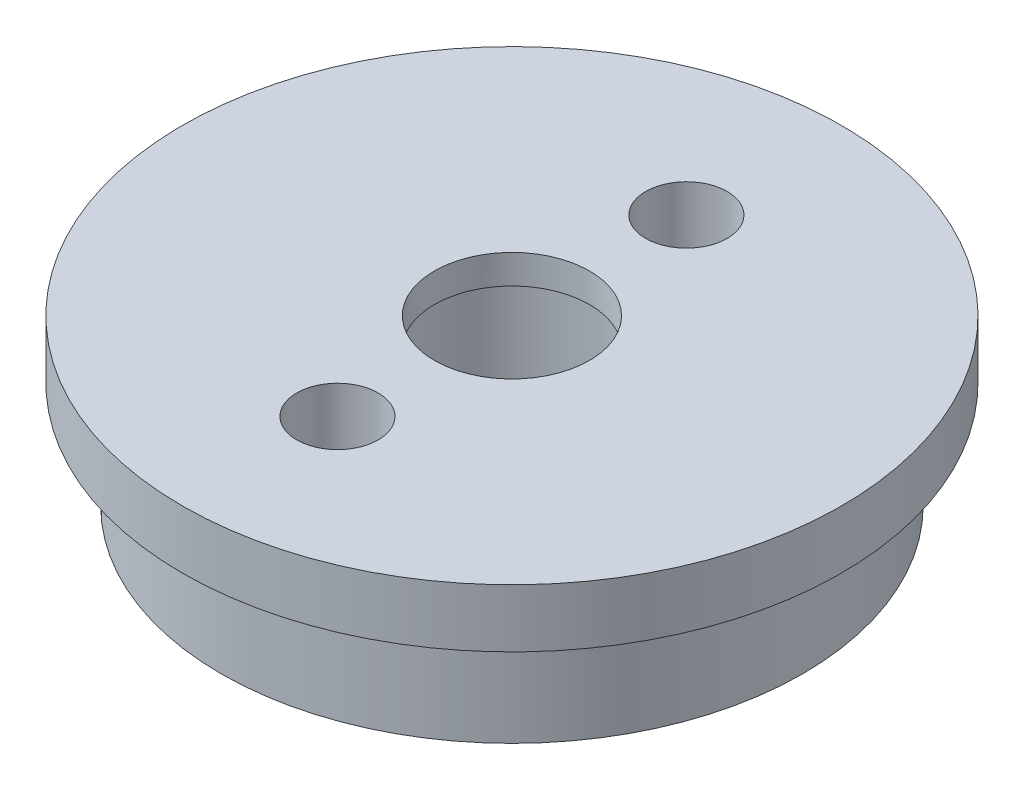
ISO-10303-21;
HEADER;
FILE_DESCRIPTION(('STEP AP214'),'2;1');
FILE_NAME('part.step','',(''),(''),'','','');
FILE_SCHEMA(('AUTOMOTIVE_DESIGN { 1 0 10303 214 1 1 1 1 }'));
ENDSEC;
DATA;
#1=APPLICATION_CONTEXT('core data for automotive mechanical design processes');
#2=APPLICATION_PROTOCOL_DEFINITION('international standard','automotive_design',2000,#1);
#3=PRODUCT_CONTEXT('',#1,'mechanical');
#4=PRODUCT('Part','Part','',(#3));
#5=PRODUCT_RELATED_PRODUCT_CATEGORY('part','',(#4));
#6=PRODUCT_DEFINITION_FORMATION('','',#4);
#7=PRODUCT_DEFINITION_CONTEXT('part definition',#1,'design');
#8=PRODUCT_DEFINITION('design','',#6,#7);
#9=PRODUCT_DEFINITION_SHAPE('','',#8);
#10=(LENGTH_UNIT() NAMED_UNIT(*) SI_UNIT(.MILLI.,.METRE.));
#11=(NAMED_UNIT(*) PLANE_ANGLE_UNIT() SI_UNIT($,.RADIAN.));
#12=(NAMED_UNIT(*) SI_UNIT($,.STERADIAN.) SOLID_ANGLE_UNIT());
#13=UNCERTAINTY_MEASURE_WITH_UNIT(LENGTH_MEASURE(1.E-05),#10,'distance_accuracy_value','');
#14=(GEOMETRIC_REPRESENTATION_CONTEXT(3) GLOBAL_UNCERTAINTY_ASSIGNED_CONTEXT((#13)) GLOBAL_UNIT_ASSIGNED_CONTEXT((#10,
#11,#12)) REPRESENTATION_CONTEXT('',''));
#15=CARTESIAN_POINT('',(0.,0.,0.));
#16=DIRECTION('',(0.,0.,1.));
#17=DIRECTION('',(1.,0.,0.));
#18=AXIS2_PLACEMENT_3D('',#15,#16,#17);
#19=CARTESIAN_POINT('',(0.,5.5,0.));
#20=DIRECTION('',(0.,-1.,0.));
#21=DIRECTION('',(0.,0.,-1.));
#22=AXIS2_PLACEMENT_3D('',#19,#20,#21);
#23=CYLINDRICAL_SURFACE('',#22,15.);
#24=CARTESIAN_POINT('',(0.,5.5,0.));
#25=DIRECTION('',(0.,1.,0.));
#26=DIRECTION('',(0.,0.,1.));
#27=AXIS2_PLACEMENT_3D('',#24,#25,#26);
#28=CIRCLE('',#27,15.);
#29=CARTESIAN_POINT('',(0.,5.5,15.));
#30=VERTEX_POINT('',#29);
#31=EDGE_CURVE('E10',#30,#30,#28,.T.);
#32=ORIENTED_EDGE('',*,*,#31,.F.);
#33=EDGE_LOOP('',(#32));
#34=FACE_BOUND('',#33,.T.);
#35=CARTESIAN_POINT('',(0.,0.,0.));
#36=DIRECTION('',(0.,1.,0.));
#37=DIRECTION('',(0.,0.,1.));
#38=AXIS2_PLACEMENT_3D('',#35,#36,#37);
#39=CIRCLE('',#38,15.);
#40=CARTESIAN_POINT('',(0.,0.,15.));
#41=VERTEX_POINT('',#40);
#42=EDGE_CURVE('E38',#41,#41,#39,.T.);
#43=ORIENTED_EDGE('',*,*,#42,.T.);
#44=EDGE_LOOP('',(#43));
#45=FACE_BOUND('',#44,.T.);
#46=ADVANCED_FACE('F31',(#34,#45),#23,.T.);
#47=CARTESIAN_POINT('',(0.,0.,0.));
#48=DIRECTION('',(0.,1.,0.));
#49=DIRECTION('',(0.,0.,1.));
#50=AXIS2_PLACEMENT_3D('',#47,#48,#49);
#51=PLANE('',#50);
#52=CARTESIAN_POINT('',(0.,0.,0.));
#53=DIRECTION('',(0.,-1.,0.));
#54=DIRECTION('',(0.,0.,-1.));
#55=AXIS2_PLACEMENT_3D('',#52,#53,#54);
#56=CIRCLE('',#55,5.1);
#57=CARTESIAN_POINT('',(0.,0.,-5.1));
#58=VERTEX_POINT('',#57);
#59=EDGE_CURVE('E51',#58,#58,#56,.T.);
#60=ORIENTED_EDGE('',*,*,#59,.F.);
#61=EDGE_LOOP('',(#60));
#62=FACE_BOUND('',#61,.T.);
#63=ORIENTED_EDGE('',*,*,#42,.F.);
#64=EDGE_LOOP('',(#63));
#65=FACE_BOUND('',#64,.T.);
#66=ADVANCED_FACE('F91',(#62,#65),#51,.F.);
#67=CARTESIAN_POINT('',(0.,8.5,0.));
#68=DIRECTION('',(0.,-1.,0.));
#69=DIRECTION('',(0.,0.,-1.));
#70=AXIS2_PLACEMENT_3D('',#67,#68,#69);
#71=CYLINDRICAL_SURFACE('',#70,17.);
#72=CARTESIAN_POINT('',(0.,8.5,0.));
#73=DIRECTION('',(0.,1.,0.));
#74=DIRECTION('',(0.,0.,1.));
#75=AXIS2_PLACEMENT_3D('',#72,#73,#74);
#76=CIRCLE('',#75,17.);
#77=CARTESIAN_POINT('',(0.,8.5,17.));
#78=VERTEX_POINT('',#77);
#79=EDGE_CURVE('E43',#78,#78,#76,.T.);
#80=ORIENTED_EDGE('',*,*,#79,.F.);
#81=EDGE_LOOP('',(#80));
#82=FACE_BOUND('',#81,.T.);
#83=CARTESIAN_POINT('',(0.,5.5,0.));
#84=DIRECTION('',(0.,1.,0.));
#85=DIRECTION('',(0.,0.,1.));
#86=AXIS2_PLACEMENT_3D('',#83,#84,#85);
#87=CIRCLE('',#86,17.);
#88=CARTESIAN_POINT('',(0.,5.5,17.));
#89=VERTEX_POINT('',#88);
#90=EDGE_CURVE('E45',#89,#89,#87,.T.);
#91=ORIENTED_EDGE('',*,*,#90,.T.);
#92=EDGE_LOOP('',(#91));
#93=FACE_BOUND('',#92,.T.);
#94=ADVANCED_FACE('F94',(#82,#93),#71,.T.);
#95=CARTESIAN_POINT('',(0.,8.5,0.));
#96=DIRECTION('',(0.,1.,0.));
#97=DIRECTION('',(0.,0.,1.));
#98=AXIS2_PLACEMENT_3D('',#95,#96,#97);
#99=PLANE('',#98);
#100=CARTESIAN_POINT('',(0.,8.5,-9.));
#101=DIRECTION('',(0.,1.,0.));
#102=DIRECTION('',(0.,0.,1.));
#103=AXIS2_PLACEMENT_3D('',#100,#101,#102);
#104=CIRCLE('',#103,2.1);
#105=CARTESIAN_POINT('',(0.,8.5,-6.9));
#106=VERTEX_POINT('',#105);
#107=EDGE_CURVE('E65',#106,#106,#104,.T.);
#108=ORIENTED_EDGE('',*,*,#107,.F.);
#109=EDGE_LOOP('',(#108));
#110=FACE_BOUND('',#109,.T.);
#111=CARTESIAN_POINT('',(0.,8.5,9.));
#112=DIRECTION('',(0.,1.,0.));
#113=DIRECTION('',(0.,0.,1.));
#114=AXIS2_PLACEMENT_3D('',#111,#112,#113);
#115=CIRCLE('',#114,2.1);
#116=CARTESIAN_POINT('',(0.,8.5,11.1));
#117=VERTEX_POINT('',#116);
#118=EDGE_CURVE('E59',#117,#117,#115,.T.);
#119=ORIENTED_EDGE('',*,*,#118,.F.);
#120=EDGE_LOOP('',(#119));
#121=FACE_BOUND('',#120,.T.);
#122=CARTESIAN_POINT('',(0.,8.5,0.));
#123=DIRECTION('',(0.,1.,0.));
#124=DIRECTION('',(0.,0.,1.));
#125=AXIS2_PLACEMENT_3D('',#122,#123,#124);
#126=CIRCLE('',#125,4.);
#127=CARTESIAN_POINT('',(0.,8.5,4.));
#128=VERTEX_POINT('',#127);
#129=EDGE_CURVE('E56',#128,#128,#126,.T.);
#130=ORIENTED_EDGE('',*,*,#129,.F.);
#131=EDGE_LOOP('',(#130));
#132=FACE_BOUND('',#131,.T.);
#133=ORIENTED_EDGE('',*,*,#79,.T.);
#134=EDGE_LOOP('',(#133));
#135=FACE_BOUND('',#134,.T.);
#136=ADVANCED_FACE('F113',(#110,#121,#132,#135),#99,.T.);
#137=CARTESIAN_POINT('',(0.,5.5,0.));
#138=DIRECTION('',(0.,1.,0.));
#139=DIRECTION('',(0.,0.,1.));
#140=AXIS2_PLACEMENT_3D('',#137,#138,#139);
#141=PLANE('',#140);
#142=ORIENTED_EDGE('',*,*,#31,.T.);
#143=EDGE_LOOP('',(#142));
#144=FACE_BOUND('',#143,.T.);
#145=ORIENTED_EDGE('',*,*,#90,.F.);
#146=EDGE_LOOP('',(#145));
#147=FACE_BOUND('',#146,.T.);
#148=ADVANCED_FACE('F87',(#144,#147),#141,.F.);
#149=CARTESIAN_POINT('',(0.,7.,0.));
#150=DIRECTION('',(0.,-1.,0.));
#151=DIRECTION('',(0.,0.,-1.));
#152=AXIS2_PLACEMENT_3D('',#149,#150,#151);
#153=CYLINDRICAL_SURFACE('',#152,5.1);
#154=CARTESIAN_POINT('',(0.,7.,0.));
#155=DIRECTION('',(0.,-1.,0.));
#156=DIRECTION('',(0.,0.,-1.));
#157=AXIS2_PLACEMENT_3D('',#154,#155,#156);
#158=CIRCLE('',#157,5.1);
#159=CARTESIAN_POINT('',(0.,7.,-5.1));
#160=VERTEX_POINT('',#159);
#161=EDGE_CURVE('E48',#160,#160,#158,.T.);
#162=ORIENTED_EDGE('',*,*,#161,.F.);
#163=EDGE_LOOP('',(#162));
#164=FACE_BOUND('',#163,.T.);
#165=ORIENTED_EDGE('',*,*,#59,.T.);
#166=EDGE_LOOP('',(#165));
#167=FACE_BOUND('',#166,.T.);
#168=ADVANCED_FACE('F81',(#164,#167),#153,.F.);
#169=CARTESIAN_POINT('',(0.,7.,0.));
#170=DIRECTION('',(0.,-1.,0.));
#171=DIRECTION('',(0.,0.,-1.));
#172=AXIS2_PLACEMENT_3D('',#169,#170,#171);
#173=PLANE('',#172);
#174=CARTESIAN_POINT('',(0.,7.,0.));
#175=DIRECTION('',(0.,-1.,0.));
#176=DIRECTION('',(0.,0.,-1.));
#177=AXIS2_PLACEMENT_3D('',#174,#175,#176);
#178=CIRCLE('',#177,4.);
#179=CARTESIAN_POINT('',(0.,7.,-4.));
#180=VERTEX_POINT('',#179);
#181=EDGE_CURVE('E34',#180,#180,#178,.T.);
#182=ORIENTED_EDGE('',*,*,#181,.F.);
#183=EDGE_LOOP('',(#182));
#184=FACE_BOUND('',#183,.T.);
#185=ORIENTED_EDGE('',*,*,#161,.T.);
#186=EDGE_LOOP('',(#185));
#187=FACE_BOUND('',#186,.T.);
#188=ADVANCED_FACE('F78',(#184,#187),#173,.T.);
#189=CARTESIAN_POINT('',(0.,2.5,0.));
#190=DIRECTION('',(0.,1.,0.));
#191=DIRECTION('',(0.,0.,1.));
#192=AXIS2_PLACEMENT_3D('',#189,#190,#191);
#193=CYLINDRICAL_SURFACE('',#192,4.);
#194=ORIENTED_EDGE('',*,*,#181,.T.);
#195=EDGE_LOOP('',(#194));
#196=FACE_BOUND('',#195,.T.);
#197=ORIENTED_EDGE('',*,*,#129,.T.);
#198=EDGE_LOOP('',(#197));
#199=FACE_BOUND('',#198,.T.);
#200=ADVANCED_FACE('F75',(#196,#199),#193,.F.);
#201=CARTESIAN_POINT('',(0.,2.5,9.));
#202=DIRECTION('',(0.,1.,0.));
#203=DIRECTION('',(0.,0.,1.));
#204=AXIS2_PLACEMENT_3D('',#201,#202,#203);
#205=CYLINDRICAL_SURFACE('',#204,2.1);
#206=CARTESIAN_POINT('',(0.,2.5,9.));
#207=DIRECTION('',(0.,1.,0.));
#208=DIRECTION('',(0.,0.,1.));
#209=AXIS2_PLACEMENT_3D('',#206,#207,#208);
#210=CIRCLE('',#209,2.1);
#211=CARTESIAN_POINT('',(0.,2.5,11.1));
#212=VERTEX_POINT('',#211);
#213=EDGE_CURVE('E62',#212,#212,#210,.T.);
#214=ORIENTED_EDGE('',*,*,#213,.F.);
#215=EDGE_LOOP('',(#214));
#216=FACE_BOUND('',#215,.T.);
#217=ORIENTED_EDGE('',*,*,#118,.T.);
#218=EDGE_LOOP('',(#217));
#219=FACE_BOUND('',#218,.T.);
#220=ADVANCED_FACE('F140',(#216,#219),#205,.F.);
#221=CARTESIAN_POINT('',(0.,2.5,9.));
#222=DIRECTION('',(0.,1.,0.));
#223=DIRECTION('',(0.,0.,1.));
#224=AXIS2_PLACEMENT_3D('',#221,#222,#223);
#225=PLANE('',#224);
#226=ORIENTED_EDGE('',*,*,#213,.T.);
#227=EDGE_LOOP('',(#226));
#228=FACE_BOUND('',#227,.T.);
#229=ADVANCED_FACE('F147',(#228),#225,.T.);
#230=CARTESIAN_POINT('',(0.,2.5,-9.));
#231=DIRECTION('',(0.,1.,0.));
#232=DIRECTION('',(0.,0.,1.));
#233=AXIS2_PLACEMENT_3D('',#230,#231,#232);
#234=CYLINDRICAL_SURFACE('',#233,2.1);
#235=CARTESIAN_POINT('',(0.,2.5,-9.));
#236=DIRECTION('',(0.,1.,0.));
#237=DIRECTION('',(0.,0.,1.));
#238=AXIS2_PLACEMENT_3D('',#235,#236,#237);
#239=CIRCLE('',#238,2.1);
#240=CARTESIAN_POINT('',(0.,2.5,-6.9));
#241=VERTEX_POINT('',#240);
#242=EDGE_CURVE('E68',#241,#241,#239,.T.);
#243=ORIENTED_EDGE('',*,*,#242,.F.);
#244=EDGE_LOOP('',(#243));
#245=FACE_BOUND('',#244,.T.);
#246=ORIENTED_EDGE('',*,*,#107,.T.);
#247=EDGE_LOOP('',(#246));
#248=FACE_BOUND('',#247,.T.);
#249=ADVANCED_FACE('F155',(#245,#248),#234,.F.);
#250=CARTESIAN_POINT('',(0.,2.5,-9.));
#251=DIRECTION('',(0.,1.,0.));
#252=DIRECTION('',(0.,0.,1.));
#253=AXIS2_PLACEMENT_3D('',#250,#251,#252);
#254=PLANE('',#253);
#255=ORIENTED_EDGE('',*,*,#242,.T.);
#256=EDGE_LOOP('',(#255));
#257=FACE_BOUND('',#256,.T.);
#258=ADVANCED_FACE('F163',(#257),#254,.T.);
#259=CLOSED_SHELL('',(#46,#66,#94,#136,#148,#168,#188,#200,#220,#229,#249,#258));
#260=MANIFOLD_SOLID_BREP('B2',#259);
#261=ADVANCED_BREP_SHAPE_REPRESENTATION('',(#18,#260),#14);
#262=SHAPE_DEFINITION_REPRESENTATION(#9,#261);
ENDSEC;
END-ISO-10303-21;
